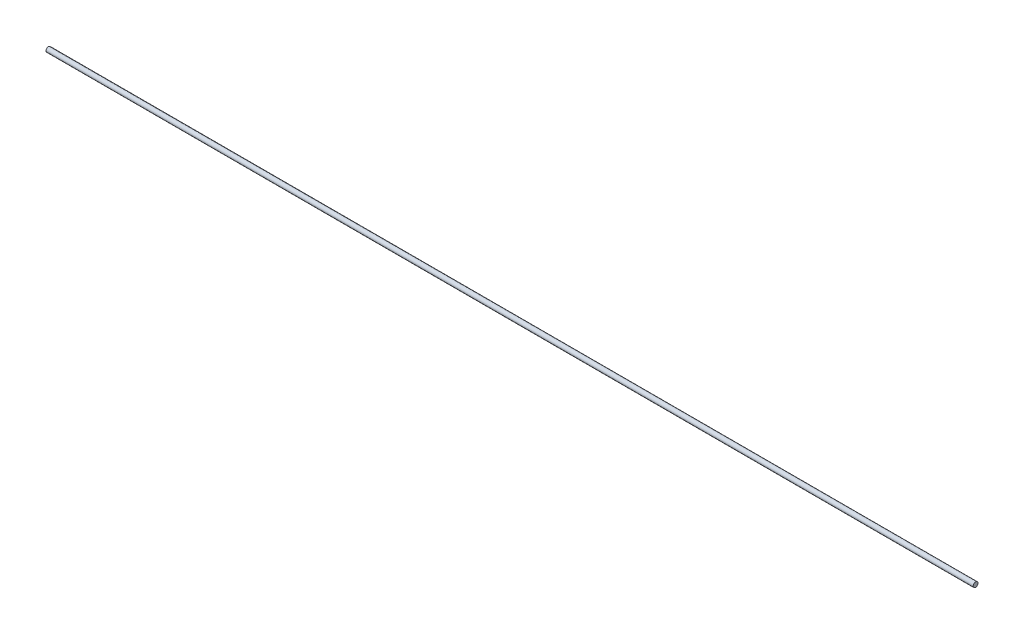
ISO-10303-21;
HEADER;
FILE_DESCRIPTION(('STEP AP214'),'2;1');
FILE_NAME('part.step','',(''),(''),'','','');
FILE_SCHEMA(('AUTOMOTIVE_DESIGN { 1 0 10303 214 1 1 1 1 }'));
ENDSEC;
DATA;
#1=APPLICATION_CONTEXT('core data for automotive mechanical design processes');
#2=APPLICATION_PROTOCOL_DEFINITION('international standard','automotive_design',2000,#1);
#3=PRODUCT_CONTEXT('',#1,'mechanical');
#4=PRODUCT('Part','Part','',(#3));
#5=PRODUCT_RELATED_PRODUCT_CATEGORY('part','',(#4));
#6=PRODUCT_DEFINITION_FORMATION('','',#4);
#7=PRODUCT_DEFINITION_CONTEXT('part definition',#1,'design');
#8=PRODUCT_DEFINITION('design','',#6,#7);
#9=PRODUCT_DEFINITION_SHAPE('','',#8);
#10=(LENGTH_UNIT() NAMED_UNIT(*) SI_UNIT(.MILLI.,.METRE.));
#11=(NAMED_UNIT(*) PLANE_ANGLE_UNIT() SI_UNIT($,.RADIAN.));
#12=(NAMED_UNIT(*) SI_UNIT($,.STERADIAN.) SOLID_ANGLE_UNIT());
#13=UNCERTAINTY_MEASURE_WITH_UNIT(LENGTH_MEASURE(1.E-05),#10,'distance_accuracy_value','');
#14=(GEOMETRIC_REPRESENTATION_CONTEXT(3) GLOBAL_UNCERTAINTY_ASSIGNED_CONTEXT((#13)) GLOBAL_UNIT_ASSIGNED_CONTEXT((#10,
#11,#12)) REPRESENTATION_CONTEXT('',''));
#15=CARTESIAN_POINT('',(0.,0.,0.));
#16=DIRECTION('',(0.,0.,1.));
#17=DIRECTION('',(1.,0.,0.));
#18=AXIS2_PLACEMENT_3D('',#15,#16,#17);
#19=CARTESIAN_POINT('',(768.293243741159,2.72965119205537,-1.02245132450207));
#20=DIRECTION('',(-1.,0.,0.));
#21=DIRECTION('',(0.,0.,1.));
#22=AXIS2_PLACEMENT_3D('',#19,#20,#21);
#23=CYLINDRICAL_SURFACE('',#22,4.);
#24=CARTESIAN_POINT('',(768.293243741159,2.72965119205537,-1.02245132450207));
#25=DIRECTION('',(1.,0.,0.));
#26=DIRECTION('',(0.,0.,-1.));
#27=AXIS2_PLACEMENT_3D('',#24,#25,#26);
#28=CIRCLE('',#27,4.);
#29=CARTESIAN_POINT('',(768.293243741159,2.72965119205537,-5.02245132450207));
#30=VERTEX_POINT('',#29);
#31=EDGE_CURVE('E9',#30,#30,#28,.T.);
#32=ORIENTED_EDGE('',*,*,#31,.F.);
#33=EDGE_LOOP('',(#32));
#34=FACE_BOUND('',#33,.T.);
#35=CARTESIAN_POINT('',(-771.706756258841,2.72965119205537,-1.02245132450207));
#36=DIRECTION('',(1.,0.,0.));
#37=DIRECTION('',(0.,0.,-1.));
#38=AXIS2_PLACEMENT_3D('',#35,#36,#37);
#39=CIRCLE('',#38,4.);
#40=CARTESIAN_POINT('',(-771.706756258841,2.72965119205537,-5.02245132450207));
#41=VERTEX_POINT('',#40);
#42=EDGE_CURVE('E17',#41,#41,#39,.T.);
#43=ORIENTED_EDGE('',*,*,#42,.T.);
#44=EDGE_LOOP('',(#43));
#45=FACE_BOUND('',#44,.T.);
#46=ADVANCED_FACE('F14',(#34,#45),#23,.T.);
#47=CARTESIAN_POINT('',(768.293243741159,2.72965119205537,-1.02245132450207));
#48=DIRECTION('',(1.,0.,0.));
#49=DIRECTION('',(0.,0.,-1.));
#50=AXIS2_PLACEMENT_3D('',#47,#48,#49);
#51=PLANE('',#50);
#52=ORIENTED_EDGE('',*,*,#31,.T.);
#53=EDGE_LOOP('',(#52));
#54=FACE_BOUND('',#53,.T.);
#55=ADVANCED_FACE('F29',(#54),#51,.T.);
#56=CARTESIAN_POINT('',(-771.706756258841,2.72965119205537,-1.02245132450207));
#57=DIRECTION('',(1.,0.,0.));
#58=DIRECTION('',(0.,0.,-1.));
#59=AXIS2_PLACEMENT_3D('',#56,#57,#58);
#60=PLANE('',#59);
#61=ORIENTED_EDGE('',*,*,#42,.F.);
#62=EDGE_LOOP('',(#61));
#63=FACE_BOUND('',#62,.T.);
#64=ADVANCED_FACE('F27',(#63),#60,.F.);
#65=CLOSED_SHELL('',(#46,#55,#64));
#66=MANIFOLD_SOLID_BREP('B1',#65);
#67=ADVANCED_BREP_SHAPE_REPRESENTATION('',(#18,#66),#14);
#68=SHAPE_DEFINITION_REPRESENTATION(#9,#67);
ENDSEC;
END-ISO-10303-21;
